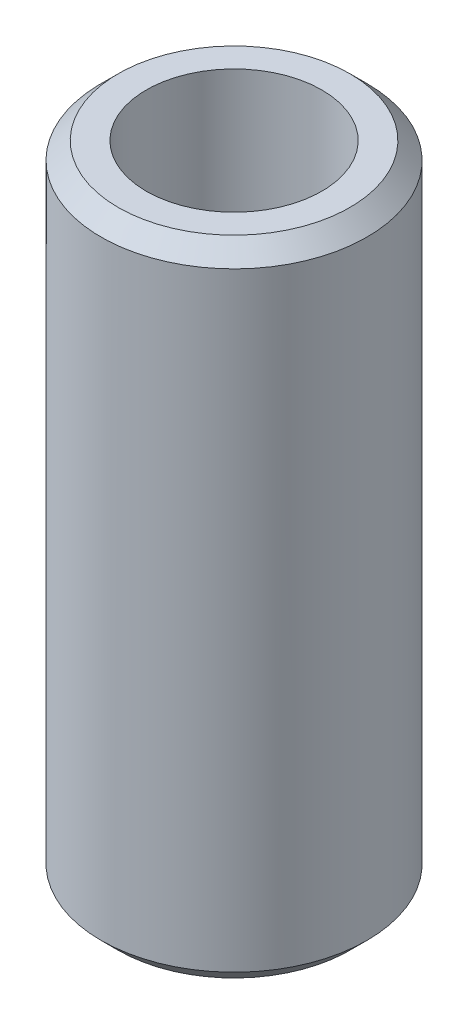
ISO-10303-21;
HEADER;
FILE_DESCRIPTION(('STEP AP214'),'2;1');
FILE_NAME('part.step','',(''),(''),'','','');
FILE_SCHEMA(('AUTOMOTIVE_DESIGN { 1 0 10303 214 1 1 1 1 }'));
ENDSEC;
DATA;
#1=APPLICATION_CONTEXT('core data for automotive mechanical design processes');
#2=APPLICATION_PROTOCOL_DEFINITION('international standard','automotive_design',2000,#1);
#3=PRODUCT_CONTEXT('',#1,'mechanical');
#4=PRODUCT('Part','Part','',(#3));
#5=PRODUCT_RELATED_PRODUCT_CATEGORY('part','',(#4));
#6=PRODUCT_DEFINITION_FORMATION('','',#4);
#7=PRODUCT_DEFINITION_CONTEXT('part definition',#1,'design');
#8=PRODUCT_DEFINITION('design','',#6,#7);
#9=PRODUCT_DEFINITION_SHAPE('','',#8);
#10=(LENGTH_UNIT() NAMED_UNIT(*) SI_UNIT(.MILLI.,.METRE.));
#11=(NAMED_UNIT(*) PLANE_ANGLE_UNIT() SI_UNIT($,.RADIAN.));
#12=(NAMED_UNIT(*) SI_UNIT($,.STERADIAN.) SOLID_ANGLE_UNIT());
#13=UNCERTAINTY_MEASURE_WITH_UNIT(LENGTH_MEASURE(1.E-05),#10,'distance_accuracy_value','');
#14=(GEOMETRIC_REPRESENTATION_CONTEXT(3) GLOBAL_UNCERTAINTY_ASSIGNED_CONTEXT((#13)) GLOBAL_UNIT_ASSIGNED_CONTEXT((#10,
#11,#12)) REPRESENTATION_CONTEXT('',''));
#15=CARTESIAN_POINT('',(0.,0.,0.));
#16=DIRECTION('',(0.,0.,1.));
#17=DIRECTION('',(1.,0.,0.));
#18=AXIS2_PLACEMENT_3D('',#15,#16,#17);
#19=CARTESIAN_POINT('',(0.,145.135448417283,0.));
#20=DIRECTION('',(0.,-1.,0.));
#21=DIRECTION('',(0.,0.,-1.));
#22=AXIS2_PLACEMENT_3D('',#19,#20,#21);
#23=CYLINDRICAL_SURFACE('',#22,30.);
#24=CARTESIAN_POINT('',(0.,141.27630628552,0.));
#25=DIRECTION('',(0.,1.,0.));
#26=DIRECTION('',(0.,0.,1.));
#27=AXIS2_PLACEMENT_3D('',#24,#25,#26);
#28=CIRCLE('',#27,30.);
#29=CARTESIAN_POINT('',(0.,141.27630628552,-30.));
#30=VERTEX_POINT('',#29);
#31=EDGE_CURVE('E50',#30,#30,#28,.F.);
#32=ORIENTED_EDGE('',*,*,#31,.T.);
#33=EDGE_LOOP('',(#32));
#34=FACE_BOUND('',#33,.T.);
#35=CARTESIAN_POINT('',(0.,3.8591421317635,0.));
#36=DIRECTION('',(0.,1.,0.));
#37=DIRECTION('',(0.,0.,1.));
#38=AXIS2_PLACEMENT_3D('',#35,#36,#37);
#39=CIRCLE('',#38,30.);
#40=CARTESIAN_POINT('',(0.,3.8591421317635,30.));
#41=VERTEX_POINT('',#40);
#42=EDGE_CURVE('E51',#41,#41,#39,.T.);
#43=ORIENTED_EDGE('',*,*,#42,.T.);
#44=EDGE_LOOP('',(#43));
#45=FACE_BOUND('',#44,.T.);
#46=ADVANCED_FACE('F39',(#34,#45),#23,.T.);
#47=CARTESIAN_POINT('',(0.,145.135448417283,0.));
#48=DIRECTION('',(0.,1.,0.));
#49=DIRECTION('',(0.,0.,1.));
#50=AXIS2_PLACEMENT_3D('',#47,#48,#49);
#51=PLANE('',#50);
#52=CARTESIAN_POINT('',(0.,145.135448417283,0.));
#53=DIRECTION('',(0.,1.,0.));
#54=DIRECTION('',(0.,0.,1.));
#55=AXIS2_PLACEMENT_3D('',#52,#53,#54);
#56=CIRCLE('',#55,26.1408578682365);
#57=CARTESIAN_POINT('',(0.,145.135448417283,-26.1408578682366));
#58=VERTEX_POINT('',#57);
#59=EDGE_CURVE('E54',#58,#58,#56,.T.);
#60=ORIENTED_EDGE('',*,*,#59,.T.);
#61=EDGE_LOOP('',(#60));
#62=FACE_BOUND('',#61,.T.);
#63=CARTESIAN_POINT('',(0.,145.135448417283,0.));
#64=DIRECTION('',(0.,1.,0.));
#65=DIRECTION('',(0.,0.,1.));
#66=AXIS2_PLACEMENT_3D('',#63,#64,#65);
#67=CIRCLE('',#66,19.805481705401);
#68=CARTESIAN_POINT('',(0.,145.135448417283,19.805481705401));
#69=VERTEX_POINT('',#68);
#70=EDGE_CURVE('E58',#69,#69,#67,.T.);
#71=ORIENTED_EDGE('',*,*,#70,.F.);
#72=EDGE_LOOP('',(#71));
#73=FACE_BOUND('',#72,.T.);
#74=ADVANCED_FACE('F69',(#62,#73),#51,.T.);
#75=CARTESIAN_POINT('',(0.,0.,0.));
#76=DIRECTION('',(0.,1.,0.));
#77=DIRECTION('',(0.,0.,1.));
#78=AXIS2_PLACEMENT_3D('',#75,#76,#77);
#79=PLANE('',#78);
#80=CARTESIAN_POINT('',(0.,0.,0.));
#81=DIRECTION('',(0.,1.,0.));
#82=DIRECTION('',(0.,0.,1.));
#83=AXIS2_PLACEMENT_3D('',#80,#81,#82);
#84=CIRCLE('',#83,26.1408578682365);
#85=CARTESIAN_POINT('',(0.,0.,26.1408578682365));
#86=VERTEX_POINT('',#85);
#87=EDGE_CURVE('E10',#86,#86,#84,.F.);
#88=ORIENTED_EDGE('',*,*,#87,.T.);
#89=EDGE_LOOP('',(#88));
#90=FACE_BOUND('',#89,.T.);
#91=CARTESIAN_POINT('',(0.,0.,0.));
#92=DIRECTION('',(0.,1.,0.));
#93=DIRECTION('',(0.,0.,1.));
#94=AXIS2_PLACEMENT_3D('',#91,#92,#93);
#95=CIRCLE('',#94,19.805481705401);
#96=CARTESIAN_POINT('',(0.,0.,19.805481705401));
#97=VERTEX_POINT('',#96);
#98=EDGE_CURVE('E63',#97,#97,#95,.T.);
#99=ORIENTED_EDGE('',*,*,#98,.T.);
#100=EDGE_LOOP('',(#99));
#101=FACE_BOUND('',#100,.T.);
#102=ADVANCED_FACE('F75',(#90,#101),#79,.F.);
#103=CARTESIAN_POINT('',(0.,145.135448417283,0.));
#104=DIRECTION('',(0.,-1.,0.));
#105=DIRECTION('',(0.,0.,-1.));
#106=AXIS2_PLACEMENT_3D('',#103,#104,#105);
#107=CYLINDRICAL_SURFACE('',#106,19.805481705401);
#108=ORIENTED_EDGE('',*,*,#70,.T.);
#109=EDGE_LOOP('',(#108));
#110=FACE_BOUND('',#109,.T.);
#111=ORIENTED_EDGE('',*,*,#98,.F.);
#112=EDGE_LOOP('',(#111));
#113=FACE_BOUND('',#112,.T.);
#114=ADVANCED_FACE('F70',(#110,#113),#107,.F.);
#115=CARTESIAN_POINT('',(0.,145.135448417283,0.));
#116=DIRECTION('',(0.,-1.,0.));
#117=DIRECTION('',(0.,0.,-1.));
#118=AXIS2_PLACEMENT_3D('',#115,#116,#117);
#119=CONICAL_SURFACE('',#118,26.1408578682365,0.785398163397447);
#120=CARTESIAN_POINT('',(0.,141.27630628552,-30.));
#121=CARTESIAN_POINT('',(0.,141.316505682725,-29.9598006027941));
#122=CARTESIAN_POINT('',(0.,141.356705079931,-29.9196012055883));
#123=CARTESIAN_POINT('',(0.,141.437103874343,-29.8392024111765));
#124=CARTESIAN_POINT('',(0.,141.477303271549,-29.7990030139707));
#125=CARTESIAN_POINT('',(0.,141.557702065961,-29.7186042195589));
#126=CARTESIAN_POINT('',(0.,141.597901463166,-29.6784048223531));
#127=CARTESIAN_POINT('',(0.,141.678300257578,-29.5980060279413));
#128=CARTESIAN_POINT('',(0.,141.718499654784,-29.5578066307354));
#129=CARTESIAN_POINT('',(0.,141.798898449196,-29.4774078363237));
#130=CARTESIAN_POINT('',(0.,141.839097846402,-29.4372084391178));
#131=CARTESIAN_POINT('',(0.,141.919496640813,-29.3568096447061));
#132=CARTESIAN_POINT('',(0.,141.959696038019,-29.3166102475002));
#133=CARTESIAN_POINT('',(0.,142.040094832431,-29.2362114530885));
#134=CARTESIAN_POINT('',(0.,142.080294229637,-29.1960120558826));
#135=CARTESIAN_POINT('',(0.,142.160693024049,-29.1156132614709));
#136=CARTESIAN_POINT('',(0.,142.200892421255,-29.075413864265));
#137=CARTESIAN_POINT('',(0.,142.281291215666,-28.9950150698533));
#138=CARTESIAN_POINT('',(0.,142.321490612872,-28.9548156726474));
#139=CARTESIAN_POINT('',(0.,142.401889407284,-28.8744168782357));
#140=CARTESIAN_POINT('',(0.,142.44208880449,-28.8342174810298));
#141=CARTESIAN_POINT('',(0.,142.522487598901,-28.7538186866181));
#142=CARTESIAN_POINT('',(0.,142.562686996107,-28.7136192894122));
#143=CARTESIAN_POINT('',(0.,142.643085790519,-28.6332204950005));
#144=CARTESIAN_POINT('',(0.,142.683285187725,-28.5930210977946));
#145=CARTESIAN_POINT('',(0.,142.763683982137,-28.5126223033828));
#146=CARTESIAN_POINT('',(0.,142.803883379343,-28.472422906177));
#147=CARTESIAN_POINT('',(0.,142.884282173754,-28.3920241117652));
#148=CARTESIAN_POINT('',(0.,142.92448157096,-28.3518247145594));
#149=CARTESIAN_POINT('',(0.,143.004880365372,-28.2714259201476));
#150=CARTESIAN_POINT('',(0.,143.045079762578,-28.2312265229418));
#151=CARTESIAN_POINT('',(0.,143.12547855699,-28.15082772853));
#152=CARTESIAN_POINT('',(0.,143.165677954195,-28.1106283313242));
#153=CARTESIAN_POINT('',(0.,143.246076748607,-28.0302295369124));
#154=CARTESIAN_POINT('',(0.,143.286276145813,-27.9900301397065));
#155=CARTESIAN_POINT('',(0.,143.366674940225,-27.9096313452948));
#156=CARTESIAN_POINT('',(0.,143.406874337431,-27.8694319480889));
#157=CARTESIAN_POINT('',(0.,143.487273131842,-27.7890331536772));
#158=CARTESIAN_POINT('',(0.,143.527472529048,-27.7488337564713));
#159=CARTESIAN_POINT('',(0.,143.60787132346,-27.6684349620596));
#160=CARTESIAN_POINT('',(0.,143.648070720666,-27.6282355648537));
#161=CARTESIAN_POINT('',(0.,143.728469515078,-27.547836770442));
#162=CARTESIAN_POINT('',(0.,143.768668912283,-27.5076373732361));
#163=CARTESIAN_POINT('',(0.,143.849067706695,-27.4272385788244));
#164=CARTESIAN_POINT('',(0.,143.889267103901,-27.3870391816185));
#165=CARTESIAN_POINT('',(0.,143.969665898313,-27.3066403872068));
#166=CARTESIAN_POINT('',(0.,144.009865295519,-27.2664409900009));
#167=CARTESIAN_POINT('',(0.,144.09026408993,-27.1860421955892));
#168=CARTESIAN_POINT('',(0.,144.130463487136,-27.1458427983833));
#169=CARTESIAN_POINT('',(0.,144.210862281548,-27.0654440039715));
#170=CARTESIAN_POINT('',(0.,144.251061678754,-27.0252446067657));
#171=CARTESIAN_POINT('',(0.,144.331460473166,-26.9448458123539));
#172=CARTESIAN_POINT('',(0.,144.371659870371,-26.9046464151481));
#173=CARTESIAN_POINT('',(0.,144.452058664783,-26.8242476207363));
#174=CARTESIAN_POINT('',(0.,144.492258061989,-26.7840482235305));
#175=CARTESIAN_POINT('',(0.,144.572656856401,-26.7036494291187));
#176=CARTESIAN_POINT('',(0.,144.612856253607,-26.6634500319129));
#177=CARTESIAN_POINT('',(0.,144.693255048018,-26.5830512375011));
#178=CARTESIAN_POINT('',(0.,144.733454445224,-26.5428518402952));
#179=CARTESIAN_POINT('',(0.,144.813853239636,-26.4624530458835));
#180=CARTESIAN_POINT('',(0.,144.854052636842,-26.4222536486776));
#181=CARTESIAN_POINT('',(0.,144.934451431254,-26.3418548542659));
#182=CARTESIAN_POINT('',(0.,144.97465082846,-26.30165545706));
#183=CARTESIAN_POINT('',(0.,145.055049622871,-26.2212566626483));
#184=CARTESIAN_POINT('',(0.,145.095249020077,-26.1810572654424));
#185=CARTESIAN_POINT('',(0.,145.135448417283,-26.1408578682366));
#186=B_SPLINE_CURVE_WITH_KNOTS('',3,(#120,#121,#122,#123,#124,#125,#126,#127,#128,#129,#130,
#131,#132,#133,#134,#135,#136,#137,#138,#139,#140,#141,#142,#143,#144,#145,#146,#147,#148,#149,
#150,#151,#152,#153,#154,#155,#156,#157,#158,#159,#160,#161,#162,#163,#164,#165,#166,#167,#168,
#169,#170,#171,#172,#173,#174,#175,#176,#177,#178,#179,#180,#181,#182,#183,#184,#185),
.UNSPECIFIED.,.F.,.F.,(4,2,2,2,2,2,2,2,2,2,2,2,2,2,2,2,2,2,2,2,2,2,2,2,2,2,2,2,2,2,2,2,4),(0.,
0.170551598183274,0.341103196366565,0.511654794549857,0.68220639273315,0.852757990916441,
1.02330958909973,1.19386118728303,1.36441278546632,1.53496438364961,1.7055159818329,
1.87606758001619,2.04661917819948,2.21717077638278,2.38772237456607,2.55827397274936,
2.72882557093265,2.89937716911593,3.06992876729922,3.24048036548251,3.41103196366581,
3.5815835618491,3.75213516003239,3.92268675821568,4.09323835639897,4.26378995458226,
4.43434155276556,4.60489315094885,4.77544474913214,4.94599634731543,5.11654794549872,
5.28709954368202,5.45765114186531),.UNSPECIFIED.);
#187=EDGE_CURVE('BSEAM81',#30,#58,#186,.T.);
#188=ORIENTED_EDGE('',*,*,#31,.F.);
#189=ORIENTED_EDGE('',*,*,#59,.F.);
#190=ORIENTED_EDGE('',*,*,#187,.T.);
#191=ORIENTED_EDGE('',*,*,#187,.F.);
#192=EDGE_LOOP('',(#188,#190,#189,#191));
#193=FACE_BOUND('',#192,.T.);
#194=ADVANCED_FACE('F81',(#193),#119,.T.);
#195=CARTESIAN_POINT('',(0.,3.8591421317635,0.));
#196=DIRECTION('',(0.,1.,0.));
#197=DIRECTION('',(0.,0.,1.));
#198=AXIS2_PLACEMENT_3D('',#195,#196,#197);
#199=CONICAL_SURFACE('',#198,30.,0.78539816339745);
#200=ORIENTED_EDGE('',*,*,#87,.F.);
#201=EDGE_LOOP('',(#200));
#202=FACE_BOUND('',#201,.T.);
#203=ORIENTED_EDGE('',*,*,#42,.F.);
#204=EDGE_LOOP('',(#203));
#205=FACE_BOUND('',#204,.T.);
#206=ADVANCED_FACE('F45',(#202,#205),#199,.T.);
#207=CLOSED_SHELL('',(#46,#74,#102,#114,#194,#206));
#208=MANIFOLD_SOLID_BREP('B2',#207);
#209=ADVANCED_BREP_SHAPE_REPRESENTATION('',(#18,#208),#14);
#210=SHAPE_DEFINITION_REPRESENTATION(#9,#209);
ENDSEC;
END-ISO-10303-21;
